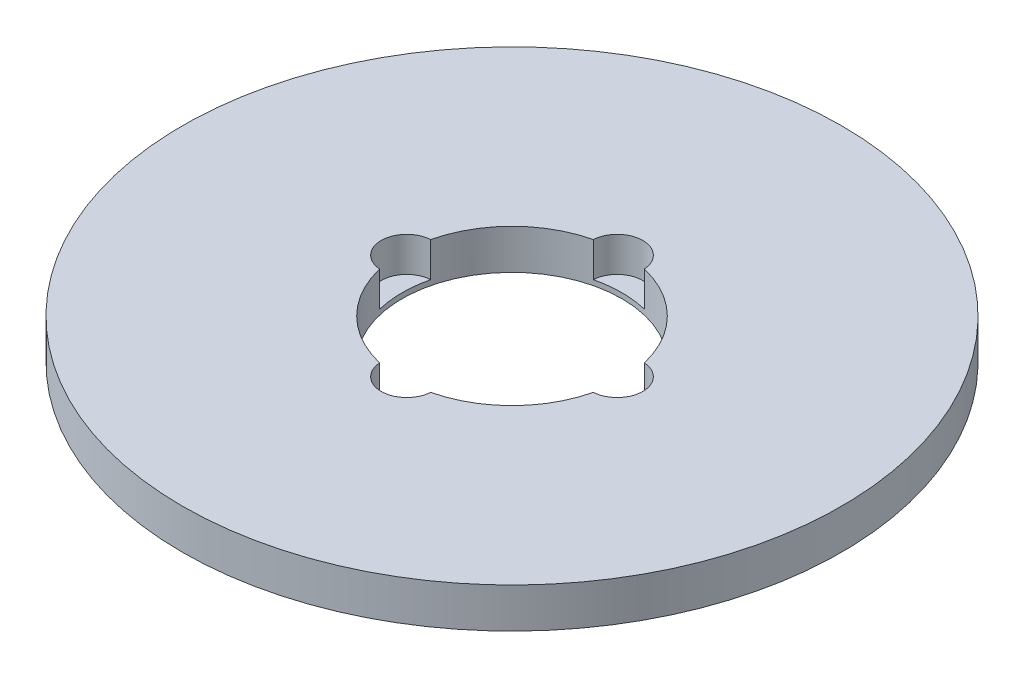
ISO-10303-21;
HEADER;
FILE_DESCRIPTION(('STEP AP214'),'2;1');
FILE_NAME('part.step','',(''),(''),'','','');
FILE_SCHEMA(('AUTOMOTIVE_DESIGN { 1 0 10303 214 1 1 1 1 }'));
ENDSEC;
DATA;
#1=APPLICATION_CONTEXT('core data for automotive mechanical design processes');
#2=APPLICATION_PROTOCOL_DEFINITION('international standard','automotive_design',2000,#1);
#3=PRODUCT_CONTEXT('',#1,'mechanical');
#4=PRODUCT('Part','Part','',(#3));
#5=PRODUCT_RELATED_PRODUCT_CATEGORY('part','',(#4));
#6=PRODUCT_DEFINITION_FORMATION('','',#4);
#7=PRODUCT_DEFINITION_CONTEXT('part definition',#1,'design');
#8=PRODUCT_DEFINITION('design','',#6,#7);
#9=PRODUCT_DEFINITION_SHAPE('','',#8);
#10=(LENGTH_UNIT() NAMED_UNIT(*) SI_UNIT(.MILLI.,.METRE.));
#11=(NAMED_UNIT(*) PLANE_ANGLE_UNIT() SI_UNIT($,.RADIAN.));
#12=(NAMED_UNIT(*) SI_UNIT($,.STERADIAN.) SOLID_ANGLE_UNIT());
#13=UNCERTAINTY_MEASURE_WITH_UNIT(LENGTH_MEASURE(1.E-05),#10,'distance_accuracy_value','');
#14=(GEOMETRIC_REPRESENTATION_CONTEXT(3) GLOBAL_UNCERTAINTY_ASSIGNED_CONTEXT((#13)) GLOBAL_UNIT_ASSIGNED_CONTEXT((#10,
#11,#12)) REPRESENTATION_CONTEXT('',''));
#15=CARTESIAN_POINT('',(0.,0.,0.));
#16=DIRECTION('',(0.,0.,1.));
#17=DIRECTION('',(1.,0.,0.));
#18=AXIS2_PLACEMENT_3D('',#15,#16,#17);
#19=CARTESIAN_POINT('',(0.,10.,0.));
#20=DIRECTION('',(0.,-1.,0.));
#21=DIRECTION('',(0.,0.,-1.));
#22=AXIS2_PLACEMENT_3D('',#19,#20,#21);
#23=CYLINDRICAL_SURFACE('',#22,82.5);
#24=CARTESIAN_POINT('',(0.,10.,0.));
#25=DIRECTION('',(0.,1.,0.));
#26=DIRECTION('',(0.,0.,1.));
#27=AXIS2_PLACEMENT_3D('',#24,#25,#26);
#28=CIRCLE('',#27,82.5);
#29=CARTESIAN_POINT('',(0.,10.,82.5));
#30=VERTEX_POINT('',#29);
#31=EDGE_CURVE('E148',#30,#30,#28,.T.);
#32=ORIENTED_EDGE('',*,*,#31,.F.);
#33=EDGE_LOOP('',(#32));
#34=FACE_BOUND('',#33,.T.);
#35=CARTESIAN_POINT('',(0.,0.,0.));
#36=DIRECTION('',(0.,1.,0.));
#37=DIRECTION('',(0.,0.,1.));
#38=AXIS2_PLACEMENT_3D('',#35,#36,#37);
#39=CIRCLE('',#38,82.5);
#40=CARTESIAN_POINT('',(0.,0.,82.5));
#41=VERTEX_POINT('',#40);
#42=EDGE_CURVE('E139',#41,#41,#39,.T.);
#43=ORIENTED_EDGE('',*,*,#42,.T.);
#44=EDGE_LOOP('',(#43));
#45=FACE_BOUND('',#44,.T.);
#46=ADVANCED_FACE('F39',(#34,#45),#23,.T.);
#47=CARTESIAN_POINT('',(0.,10.,0.));
#48=DIRECTION('',(0.,1.,0.));
#49=DIRECTION('',(0.,0.,1.));
#50=AXIS2_PLACEMENT_3D('',#47,#48,#49);
#51=PLANE('',#50);
#52=CARTESIAN_POINT('',(0.,10.,26.3440425746032));
#53=DIRECTION('',(0.,1.,0.));
#54=DIRECTION('',(1.,0.,0.));
#55=AXIS2_PLACEMENT_3D('',#52,#53,#54);
#56=CIRCLE('',#55,6.40164532612772);
#57=CARTESIAN_POINT('',(-6.38891537516344,10.,26.7475561561987));
#58=VERTEX_POINT('',#57);
#59=CARTESIAN_POINT('',(6.38891537516362,10.,26.7475561561986));
#60=VERTEX_POINT('',#59);
#61=EDGE_CURVE('E175',#58,#60,#56,.T.);
#62=ORIENTED_EDGE('',*,*,#61,.F.);
#63=CARTESIAN_POINT('',(0.,10.,0.));
#64=DIRECTION('',(0.,1.,0.));
#65=DIRECTION('',(0.,0.,1.));
#66=AXIS2_PLACEMENT_3D('',#63,#64,#65);
#67=CIRCLE('',#66,27.5);
#68=CARTESIAN_POINT('',(-26.7475561561986,10.,6.38891537516353));
#69=VERTEX_POINT('',#68);
#70=EDGE_CURVE('E134',#69,#58,#67,.T.);
#71=ORIENTED_EDGE('',*,*,#70,.F.);
#72=CARTESIAN_POINT('',(-26.3440425746032,10.,0.));
#73=DIRECTION('',(0.,1.,0.));
#74=DIRECTION('',(0.,0.,1.));
#75=AXIS2_PLACEMENT_3D('',#72,#73,#74);
#76=CIRCLE('',#75,6.40164532612772);
#77=CARTESIAN_POINT('',(-26.7475561561986,10.,-6.38891537516353));
#78=VERTEX_POINT('',#77);
#79=EDGE_CURVE('E143',#78,#69,#76,.T.);
#80=ORIENTED_EDGE('',*,*,#79,.F.);
#81=CARTESIAN_POINT('',(-6.38891537516381,10.,-26.7475561561986));
#82=VERTEX_POINT('',#81);
#83=EDGE_CURVE('E123',#82,#78,#67,.T.);
#84=ORIENTED_EDGE('',*,*,#83,.F.);
#85=CARTESIAN_POINT('',(-2.75939199116748E-13,10.,-26.3440425746032));
#86=DIRECTION('',(0.,1.,0.));
#87=DIRECTION('',(-1.,0.,0.));
#88=AXIS2_PLACEMENT_3D('',#85,#86,#87);
#89=CIRCLE('',#88,6.40164532612772);
#90=CARTESIAN_POINT('',(6.38891537516325,10.,-26.7475561561987));
#91=VERTEX_POINT('',#90);
#92=EDGE_CURVE('E106',#91,#82,#89,.T.);
#93=ORIENTED_EDGE('',*,*,#92,.F.);
#94=CARTESIAN_POINT('',(26.7475561561986,10.,-6.38891537516353));
#95=VERTEX_POINT('',#94);
#96=EDGE_CURVE('E125',#95,#91,#67,.T.);
#97=ORIENTED_EDGE('',*,*,#96,.F.);
#98=CARTESIAN_POINT('',(26.3440425746032,10.,0.));
#99=DIRECTION('',(0.,1.,0.));
#100=DIRECTION('',(0.,0.,-1.));
#101=AXIS2_PLACEMENT_3D('',#98,#99,#100);
#102=CIRCLE('',#101,6.40164532612772);
#103=CARTESIAN_POINT('',(26.7475561561986,10.,6.38891537516353));
#104=VERTEX_POINT('',#103);
#105=EDGE_CURVE('E286',#104,#95,#102,.T.);
#106=ORIENTED_EDGE('',*,*,#105,.F.);
#107=EDGE_CURVE('E135',#60,#104,#67,.T.);
#108=ORIENTED_EDGE('',*,*,#107,.F.);
#109=EDGE_LOOP('',(#62,#71,#80,#84,#93,#97,#106,#108));
#110=FACE_BOUND('',#109,.T.);
#111=ORIENTED_EDGE('',*,*,#31,.T.);
#112=EDGE_LOOP('',(#111));
#113=FACE_BOUND('',#112,.T.);
#114=ADVANCED_FACE('F118',(#110,#113),#51,.T.);
#115=CARTESIAN_POINT('',(0.,0.,0.));
#116=DIRECTION('',(0.,1.,0.));
#117=DIRECTION('',(0.,0.,1.));
#118=AXIS2_PLACEMENT_3D('',#115,#116,#117);
#119=PLANE('',#118);
#120=CARTESIAN_POINT('',(0.,0.,0.));
#121=DIRECTION('',(0.,1.,0.));
#122=DIRECTION('',(0.,0.,1.));
#123=AXIS2_PLACEMENT_3D('',#120,#121,#122);
#124=CIRCLE('',#123,27.5);
#125=CARTESIAN_POINT('',(0.,0.,27.5));
#126=VERTEX_POINT('',#125);
#127=EDGE_CURVE('E136',#126,#126,#124,.T.);
#128=ORIENTED_EDGE('',*,*,#127,.T.);
#129=EDGE_LOOP('',(#128));
#130=FACE_BOUND('',#129,.T.);
#131=ORIENTED_EDGE('',*,*,#42,.F.);
#132=EDGE_LOOP('',(#131));
#133=FACE_BOUND('',#132,.T.);
#134=ADVANCED_FACE('F187',(#130,#133),#119,.F.);
#135=CARTESIAN_POINT('',(0.,10.,0.));
#136=DIRECTION('',(0.,-1.,0.));
#137=DIRECTION('',(0.,0.,-1.));
#138=AXIS2_PLACEMENT_3D('',#135,#136,#137);
#139=CYLINDRICAL_SURFACE('',#138,27.5);
#140=DIRECTION('',(0.,1.,0.));
#141=VECTOR('',#140,1.);
#142=CARTESIAN_POINT('',(-6.38891537516344,5.65145576650589,26.7475561561987));
#143=LINE('',#142,#141);
#144=CARTESIAN_POINT('',(-6.38891537516344,1.30291153301177,26.7475561561987));
#145=VERTEX_POINT('',#144);
#146=EDGE_CURVE('E11',#145,#58,#143,.T.);
#147=ORIENTED_EDGE('',*,*,#146,.F.);
#148=CARTESIAN_POINT('',(0.,1.30291153301177,0.));
#149=DIRECTION('',(0.,1.,0.));
#150=DIRECTION('',(0.,0.,1.));
#151=AXIS2_PLACEMENT_3D('',#148,#149,#150);
#152=CIRCLE('',#151,27.5);
#153=CARTESIAN_POINT('',(6.38891537516362,1.30291153301177,26.7475561561986));
#154=VERTEX_POINT('',#153);
#155=EDGE_CURVE('E170',#145,#154,#152,.T.);
#156=ORIENTED_EDGE('',*,*,#155,.T.);
#157=DIRECTION('',(0.,1.,0.));
#158=VECTOR('',#157,1.);
#159=CARTESIAN_POINT('',(6.38891537516362,5.65145576650589,26.7475561561986));
#160=LINE('',#159,#158);
#161=EDGE_CURVE('E46',#60,#154,#160,.F.);
#162=ORIENTED_EDGE('',*,*,#161,.F.);
#163=ORIENTED_EDGE('',*,*,#107,.T.);
#164=DIRECTION('',(0.,1.,0.));
#165=VECTOR('',#164,1.);
#166=CARTESIAN_POINT('',(26.7475561561986,5.65145576650589,6.38891537516353));
#167=LINE('',#166,#165);
#168=CARTESIAN_POINT('',(26.7475561561986,1.30291153301177,6.38891537516353));
#169=VERTEX_POINT('',#168);
#170=EDGE_CURVE('E164',#169,#104,#167,.T.);
#171=ORIENTED_EDGE('',*,*,#170,.F.);
#172=CARTESIAN_POINT('',(0.,1.30291153301177,0.));
#173=DIRECTION('',(0.,1.,0.));
#174=DIRECTION('',(0.,0.,1.));
#175=AXIS2_PLACEMENT_3D('',#172,#173,#174);
#176=CIRCLE('',#175,27.5);
#177=CARTESIAN_POINT('',(26.7475561561986,1.30291153301177,-6.38891537516353));
#178=VERTEX_POINT('',#177);
#179=EDGE_CURVE('E115',#169,#178,#176,.T.);
#180=ORIENTED_EDGE('',*,*,#179,.T.);
#181=DIRECTION('',(0.,1.,0.));
#182=VECTOR('',#181,1.);
#183=CARTESIAN_POINT('',(26.7475561561986,5.65145576650589,-6.38891537516353));
#184=LINE('',#183,#182);
#185=EDGE_CURVE('E131',#95,#178,#184,.F.);
#186=ORIENTED_EDGE('',*,*,#185,.F.);
#187=ORIENTED_EDGE('',*,*,#96,.T.);
#188=DIRECTION('',(0.,1.,0.));
#189=VECTOR('',#188,1.);
#190=CARTESIAN_POINT('',(6.38891537516325,5.65145576650589,-26.7475561561987));
#191=LINE('',#190,#189);
#192=CARTESIAN_POINT('',(6.38891537516325,1.30291153301177,-26.7475561561987));
#193=VERTEX_POINT('',#192);
#194=EDGE_CURVE('E105',#193,#91,#191,.T.);
#195=ORIENTED_EDGE('',*,*,#194,.F.);
#196=CARTESIAN_POINT('',(0.,1.30291153301177,0.));
#197=DIRECTION('',(0.,1.,0.));
#198=DIRECTION('',(0.,0.,1.));
#199=AXIS2_PLACEMENT_3D('',#196,#197,#198);
#200=CIRCLE('',#199,27.5);
#201=CARTESIAN_POINT('',(-6.38891537516381,1.30291153301177,-26.7475561561986));
#202=VERTEX_POINT('',#201);
#203=EDGE_CURVE('E159',#193,#202,#200,.T.);
#204=ORIENTED_EDGE('',*,*,#203,.T.);
#205=DIRECTION('',(0.,1.,0.));
#206=VECTOR('',#205,1.);
#207=CARTESIAN_POINT('',(-6.38891537516381,5.65145576650589,-26.7475561561986));
#208=LINE('',#207,#206);
#209=EDGE_CURVE('E114',#82,#202,#208,.F.);
#210=ORIENTED_EDGE('',*,*,#209,.F.);
#211=ORIENTED_EDGE('',*,*,#83,.T.);
#212=DIRECTION('',(0.,1.,0.));
#213=VECTOR('',#212,1.);
#214=CARTESIAN_POINT('',(-26.7475561561986,5.65145576650589,-6.38891537516353));
#215=LINE('',#214,#213);
#216=CARTESIAN_POINT('',(-26.7475561561986,1.30291153301177,-6.38891537516353));
#217=VERTEX_POINT('',#216);
#218=EDGE_CURVE('E160',#217,#78,#215,.T.);
#219=ORIENTED_EDGE('',*,*,#218,.F.);
#220=CARTESIAN_POINT('',(0.,1.30291153301177,0.));
#221=DIRECTION('',(0.,1.,0.));
#222=DIRECTION('',(0.,0.,1.));
#223=AXIS2_PLACEMENT_3D('',#220,#221,#222);
#224=CIRCLE('',#223,27.5);
#225=CARTESIAN_POINT('',(-26.7475561561986,1.30291153301177,6.38891537516353));
#226=VERTEX_POINT('',#225);
#227=EDGE_CURVE('E149',#217,#226,#224,.T.);
#228=ORIENTED_EDGE('',*,*,#227,.T.);
#229=DIRECTION('',(0.,1.,0.));
#230=VECTOR('',#229,1.);
#231=CARTESIAN_POINT('',(-26.7475561561986,5.65145576650589,6.38891537516353));
#232=LINE('',#231,#230);
#233=EDGE_CURVE('E152',#69,#226,#232,.F.);
#234=ORIENTED_EDGE('',*,*,#233,.F.);
#235=ORIENTED_EDGE('',*,*,#70,.T.);
#236=EDGE_LOOP('',(#147,#156,#162,#163,#171,#180,#186,#187,#195,#204,#210,#211,#219,#228,#234,#235));
#237=FACE_BOUND('',#236,.T.);
#238=ORIENTED_EDGE('',*,*,#127,.F.);
#239=EDGE_LOOP('',(#238));
#240=FACE_BOUND('',#239,.T.);
#241=ADVANCED_FACE('F126',(#237,#240),#139,.F.);
#242=CARTESIAN_POINT('',(-26.3440425746032,1.30291153301177,0.));
#243=DIRECTION('',(0.,1.,0.));
#244=DIRECTION('',(0.,0.,1.));
#245=AXIS2_PLACEMENT_3D('',#242,#243,#244);
#246=CYLINDRICAL_SURFACE('',#245,6.40164532612772);
#247=ORIENTED_EDGE('',*,*,#218,.T.);
#248=ORIENTED_EDGE('',*,*,#79,.T.);
#249=ORIENTED_EDGE('',*,*,#233,.T.);
#250=CARTESIAN_POINT('',(-26.3440425746032,1.30291153301177,0.));
#251=DIRECTION('',(0.,1.,0.));
#252=DIRECTION('',(0.,0.,1.));
#253=AXIS2_PLACEMENT_3D('',#250,#251,#252);
#254=CIRCLE('',#253,6.40164532612772);
#255=EDGE_CURVE('E144',#217,#226,#254,.T.);
#256=ORIENTED_EDGE('',*,*,#255,.F.);
#257=EDGE_LOOP('',(#247,#248,#249,#256));
#258=FACE_BOUND('',#257,.T.);
#259=ADVANCED_FACE('F200',(#258),#246,.F.);
#260=CARTESIAN_POINT('',(-26.3440425746032,1.30291153301177,0.));
#261=DIRECTION('',(0.,1.,0.));
#262=DIRECTION('',(0.,0.,1.));
#263=AXIS2_PLACEMENT_3D('',#260,#261,#262);
#264=PLANE('',#263);
#265=ORIENTED_EDGE('',*,*,#255,.T.);
#266=ORIENTED_EDGE('',*,*,#227,.F.);
#267=EDGE_LOOP('',(#265,#266));
#268=FACE_BOUND('',#267,.T.);
#269=ADVANCED_FACE('F201',(#268),#264,.T.);
#270=CARTESIAN_POINT('',(-2.75939199116748E-13,1.30291153301177,-26.3440425746032));
#271=DIRECTION('',(0.,1.,0.));
#272=DIRECTION('',(0.,0.,1.));
#273=AXIS2_PLACEMENT_3D('',#270,#271,#272);
#274=CYLINDRICAL_SURFACE('',#273,6.40164532612772);
#275=ORIENTED_EDGE('',*,*,#194,.T.);
#276=ORIENTED_EDGE('',*,*,#92,.T.);
#277=ORIENTED_EDGE('',*,*,#209,.T.);
#278=CARTESIAN_POINT('',(-2.75939199116748E-13,1.30291153301177,-26.3440425746032));
#279=DIRECTION('',(0.,1.,0.));
#280=DIRECTION('',(-1.,0.,0.));
#281=AXIS2_PLACEMENT_3D('',#278,#279,#280);
#282=CIRCLE('',#281,6.40164532612772);
#283=EDGE_CURVE('E107',#193,#202,#282,.T.);
#284=ORIENTED_EDGE('',*,*,#283,.F.);
#285=EDGE_LOOP('',(#275,#276,#277,#284));
#286=FACE_BOUND('',#285,.T.);
#287=ADVANCED_FACE('F102',(#286),#274,.F.);
#288=CARTESIAN_POINT('',(-2.75939199116748E-13,1.30291153301177,-26.3440425746032));
#289=DIRECTION('',(0.,1.,0.));
#290=DIRECTION('',(-1.,0.,0.));
#291=AXIS2_PLACEMENT_3D('',#288,#289,#290);
#292=PLANE('',#291);
#293=ORIENTED_EDGE('',*,*,#283,.T.);
#294=ORIENTED_EDGE('',*,*,#203,.F.);
#295=EDGE_LOOP('',(#293,#294));
#296=FACE_BOUND('',#295,.T.);
#297=ADVANCED_FACE('F209',(#296),#292,.T.);
#298=CARTESIAN_POINT('',(26.3440425746032,1.30291153301177,0.));
#299=DIRECTION('',(0.,1.,0.));
#300=DIRECTION('',(0.,0.,1.));
#301=AXIS2_PLACEMENT_3D('',#298,#299,#300);
#302=CYLINDRICAL_SURFACE('',#301,6.40164532612772);
#303=ORIENTED_EDGE('',*,*,#170,.T.);
#304=ORIENTED_EDGE('',*,*,#105,.T.);
#305=ORIENTED_EDGE('',*,*,#185,.T.);
#306=CARTESIAN_POINT('',(26.3440425746032,1.30291153301177,0.));
#307=DIRECTION('',(0.,1.,0.));
#308=DIRECTION('',(0.,0.,-1.));
#309=AXIS2_PLACEMENT_3D('',#306,#307,#308);
#310=CIRCLE('',#309,6.40164532612772);
#311=EDGE_CURVE('E56',#169,#178,#310,.T.);
#312=ORIENTED_EDGE('',*,*,#311,.F.);
#313=EDGE_LOOP('',(#303,#304,#305,#312));
#314=FACE_BOUND('',#313,.T.);
#315=ADVANCED_FACE('F213',(#314),#302,.F.);
#316=CARTESIAN_POINT('',(26.3440425746032,1.30291153301177,0.));
#317=DIRECTION('',(0.,1.,0.));
#318=DIRECTION('',(0.,0.,-1.));
#319=AXIS2_PLACEMENT_3D('',#316,#317,#318);
#320=PLANE('',#319);
#321=ORIENTED_EDGE('',*,*,#311,.T.);
#322=ORIENTED_EDGE('',*,*,#179,.F.);
#323=EDGE_LOOP('',(#321,#322));
#324=FACE_BOUND('',#323,.T.);
#325=ADVANCED_FACE('F179',(#324),#320,.T.);
#326=CARTESIAN_POINT('',(0.,1.30291153301177,26.3440425746032));
#327=DIRECTION('',(0.,1.,0.));
#328=DIRECTION('',(0.,0.,1.));
#329=AXIS2_PLACEMENT_3D('',#326,#327,#328);
#330=CYLINDRICAL_SURFACE('',#329,6.40164532612772);
#331=ORIENTED_EDGE('',*,*,#146,.T.);
#332=ORIENTED_EDGE('',*,*,#61,.T.);
#333=ORIENTED_EDGE('',*,*,#161,.T.);
#334=CARTESIAN_POINT('',(0.,1.30291153301177,26.3440425746032));
#335=DIRECTION('',(0.,1.,0.));
#336=DIRECTION('',(1.,0.,0.));
#337=AXIS2_PLACEMENT_3D('',#334,#335,#336);
#338=CIRCLE('',#337,6.40164532612772);
#339=EDGE_CURVE('E55',#145,#154,#338,.T.);
#340=ORIENTED_EDGE('',*,*,#339,.F.);
#341=EDGE_LOOP('',(#331,#332,#333,#340));
#342=FACE_BOUND('',#341,.T.);
#343=ADVANCED_FACE('F171',(#342),#330,.F.);
#344=CARTESIAN_POINT('',(0.,1.30291153301177,26.3440425746032));
#345=DIRECTION('',(0.,1.,0.));
#346=DIRECTION('',(1.,0.,0.));
#347=AXIS2_PLACEMENT_3D('',#344,#345,#346);
#348=PLANE('',#347);
#349=ORIENTED_EDGE('',*,*,#339,.T.);
#350=ORIENTED_EDGE('',*,*,#155,.F.);
#351=EDGE_LOOP('',(#349,#350));
#352=FACE_BOUND('',#351,.T.);
#353=ADVANCED_FACE('F173',(#352),#348,.T.);
#354=CLOSED_SHELL('',(#46,#114,#134,#241,#259,#269,#287,#297,#315,#325,#343,#353));
#355=MANIFOLD_SOLID_BREP('B2',#354);
#356=ADVANCED_BREP_SHAPE_REPRESENTATION('',(#18,#355),#14);
#357=SHAPE_DEFINITION_REPRESENTATION(#9,#356);
ENDSEC;
END-ISO-10303-21;
